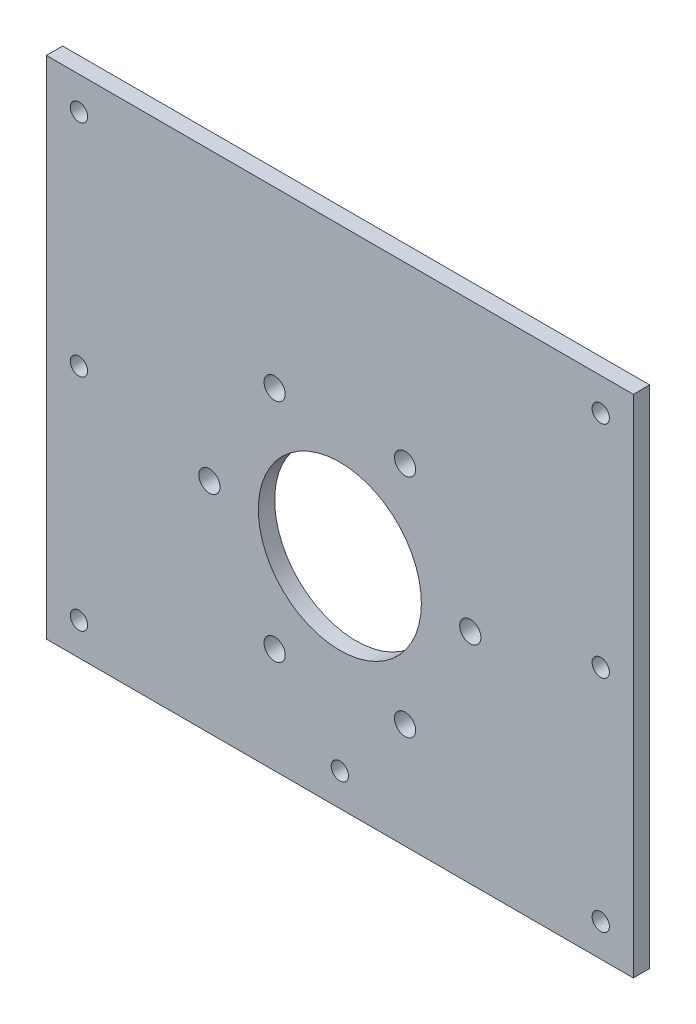
ISO-10303-21;
HEADER;
FILE_DESCRIPTION(('STEP AP214'),'2;1');
FILE_NAME('part.step','',(''),(''),'','','');
FILE_SCHEMA(('AUTOMOTIVE_DESIGN { 1 0 10303 214 1 1 1 1 }'));
ENDSEC;
DATA;
#1=APPLICATION_CONTEXT('core data for automotive mechanical design processes');
#2=APPLICATION_PROTOCOL_DEFINITION('international standard','automotive_design',2000,#1);
#3=PRODUCT_CONTEXT('',#1,'mechanical');
#4=PRODUCT('Part','Part','',(#3));
#5=PRODUCT_RELATED_PRODUCT_CATEGORY('part','',(#4));
#6=PRODUCT_DEFINITION_FORMATION('','',#4);
#7=PRODUCT_DEFINITION_CONTEXT('part definition',#1,'design');
#8=PRODUCT_DEFINITION('design','',#6,#7);
#9=PRODUCT_DEFINITION_SHAPE('','',#8);
#10=(LENGTH_UNIT() NAMED_UNIT(*) SI_UNIT(.MILLI.,.METRE.));
#11=(NAMED_UNIT(*) PLANE_ANGLE_UNIT() SI_UNIT($,.RADIAN.));
#12=(NAMED_UNIT(*) SI_UNIT($,.STERADIAN.) SOLID_ANGLE_UNIT());
#13=UNCERTAINTY_MEASURE_WITH_UNIT(LENGTH_MEASURE(1.E-05),#10,'distance_accuracy_value','');
#14=(GEOMETRIC_REPRESENTATION_CONTEXT(3) GLOBAL_UNCERTAINTY_ASSIGNED_CONTEXT((#13)) GLOBAL_UNIT_ASSIGNED_CONTEXT((#10,
#11,#12)) REPRESENTATION_CONTEXT('',''));
#15=CARTESIAN_POINT('',(0.,0.,0.));
#16=DIRECTION('',(0.,0.,1.));
#17=DIRECTION('',(1.,0.,0.));
#18=AXIS2_PLACEMENT_3D('',#15,#16,#17);
#19=CARTESIAN_POINT('',(0.,0.,5.));
#20=DIRECTION('',(1.,0.,0.));
#21=DIRECTION('',(0.,0.,-1.));
#22=AXIS2_PLACEMENT_3D('',#19,#20,#21);
#23=PLANE('',#22);
#24=DIRECTION('',(0.,-1.,0.));
#25=VECTOR('',#24,1.);
#26=CARTESIAN_POINT('',(0.,0.,0.));
#27=LINE('',#26,#25);
#28=CARTESIAN_POINT('',(0.,155.,0.));
#29=VERTEX_POINT('',#28);
#30=CARTESIAN_POINT('',(0.,0.,0.));
#31=VERTEX_POINT('',#30);
#32=EDGE_CURVE('E101',#29,#31,#27,.T.);
#33=ORIENTED_EDGE('',*,*,#32,.T.);
#34=DIRECTION('',(0.,0.,-1.));
#35=VECTOR('',#34,1.);
#36=CARTESIAN_POINT('',(0.,0.,5.));
#37=LINE('',#36,#35);
#38=CARTESIAN_POINT('',(0.,0.,5.));
#39=VERTEX_POINT('',#38);
#40=EDGE_CURVE('E11',#39,#31,#37,.T.);
#41=ORIENTED_EDGE('',*,*,#40,.F.);
#42=DIRECTION('',(0.,-1.,0.));
#43=VECTOR('',#42,1.);
#44=CARTESIAN_POINT('',(0.,0.,5.));
#45=LINE('',#44,#43);
#46=CARTESIAN_POINT('',(0.,155.,5.));
#47=VERTEX_POINT('',#46);
#48=EDGE_CURVE('E89',#47,#39,#45,.T.);
#49=ORIENTED_EDGE('',*,*,#48,.F.);
#50=DIRECTION('',(0.,0.,-1.));
#51=VECTOR('',#50,1.);
#52=CARTESIAN_POINT('',(0.,155.,5.));
#53=LINE('',#52,#51);
#54=EDGE_CURVE('E97',#47,#29,#53,.T.);
#55=ORIENTED_EDGE('',*,*,#54,.T.);
#56=EDGE_LOOP('',(#33,#41,#49,#55));
#57=FACE_BOUND('',#56,.T.);
#58=ADVANCED_FACE('F38',(#57),#23,.F.);
#59=CARTESIAN_POINT('',(0.,0.,5.));
#60=DIRECTION('',(0.,1.,0.));
#61=DIRECTION('',(0.,0.,1.));
#62=AXIS2_PLACEMENT_3D('',#59,#60,#61);
#63=PLANE('',#62);
#64=DIRECTION('',(1.,0.,0.));
#65=VECTOR('',#64,1.);
#66=CARTESIAN_POINT('',(0.,0.,0.));
#67=LINE('',#66,#65);
#68=CARTESIAN_POINT('',(180.,0.,0.));
#69=VERTEX_POINT('',#68);
#70=EDGE_CURVE('E93',#31,#69,#67,.T.);
#71=ORIENTED_EDGE('',*,*,#70,.T.);
#72=DIRECTION('',(0.,0.,-1.));
#73=VECTOR('',#72,1.);
#74=CARTESIAN_POINT('',(180.,0.,5.));
#75=LINE('',#74,#73);
#76=CARTESIAN_POINT('',(180.,0.,5.));
#77=VERTEX_POINT('',#76);
#78=EDGE_CURVE('E46',#77,#69,#75,.T.);
#79=ORIENTED_EDGE('',*,*,#78,.F.);
#80=DIRECTION('',(1.,0.,0.));
#81=VECTOR('',#80,1.);
#82=CARTESIAN_POINT('',(0.,0.,5.));
#83=LINE('',#82,#81);
#84=EDGE_CURVE('E84',#39,#77,#83,.T.);
#85=ORIENTED_EDGE('',*,*,#84,.F.);
#86=ORIENTED_EDGE('',*,*,#40,.T.);
#87=EDGE_LOOP('',(#71,#79,#85,#86));
#88=FACE_BOUND('',#87,.T.);
#89=ADVANCED_FACE('F92',(#88),#63,.F.);
#90=CARTESIAN_POINT('',(180.,0.,5.));
#91=DIRECTION('',(-1.,0.,0.));
#92=DIRECTION('',(0.,0.,1.));
#93=AXIS2_PLACEMENT_3D('',#90,#91,#92);
#94=PLANE('',#93);
#95=DIRECTION('',(0.,1.,0.));
#96=VECTOR('',#95,1.);
#97=CARTESIAN_POINT('',(180.,0.,0.));
#98=LINE('',#97,#96);
#99=CARTESIAN_POINT('',(180.,155.,0.));
#100=VERTEX_POINT('',#99);
#101=EDGE_CURVE('E71',#69,#100,#98,.T.);
#102=ORIENTED_EDGE('',*,*,#101,.T.);
#103=DIRECTION('',(0.,0.,-1.));
#104=VECTOR('',#103,1.);
#105=CARTESIAN_POINT('',(180.,155.,5.));
#106=LINE('',#105,#104);
#107=CARTESIAN_POINT('',(180.,155.,5.));
#108=VERTEX_POINT('',#107);
#109=EDGE_CURVE('E94',#108,#100,#106,.T.);
#110=ORIENTED_EDGE('',*,*,#109,.F.);
#111=DIRECTION('',(0.,1.,0.));
#112=VECTOR('',#111,1.);
#113=CARTESIAN_POINT('',(180.,0.,5.));
#114=LINE('',#113,#112);
#115=EDGE_CURVE('E87',#77,#108,#114,.T.);
#116=ORIENTED_EDGE('',*,*,#115,.F.);
#117=ORIENTED_EDGE('',*,*,#78,.T.);
#118=EDGE_LOOP('',(#102,#110,#116,#117));
#119=FACE_BOUND('',#118,.T.);
#120=ADVANCED_FACE('F95',(#119),#94,.F.);
#121=CARTESIAN_POINT('',(0.,155.,5.));
#122=DIRECTION('',(0.,-1.,0.));
#123=DIRECTION('',(0.,0.,-1.));
#124=AXIS2_PLACEMENT_3D('',#121,#122,#123);
#125=PLANE('',#124);
#126=DIRECTION('',(-1.,0.,0.));
#127=VECTOR('',#126,1.);
#128=CARTESIAN_POINT('',(0.,155.,0.));
#129=LINE('',#128,#127);
#130=EDGE_CURVE('E77',#100,#29,#129,.T.);
#131=ORIENTED_EDGE('',*,*,#130,.T.);
#132=ORIENTED_EDGE('',*,*,#54,.F.);
#133=DIRECTION('',(-1.,0.,0.));
#134=VECTOR('',#133,1.);
#135=CARTESIAN_POINT('',(0.,155.,5.));
#136=LINE('',#135,#134);
#137=EDGE_CURVE('E54',#108,#47,#136,.T.);
#138=ORIENTED_EDGE('',*,*,#137,.F.);
#139=ORIENTED_EDGE('',*,*,#109,.T.);
#140=EDGE_LOOP('',(#131,#132,#138,#139));
#141=FACE_BOUND('',#140,.T.);
#142=ADVANCED_FACE('F109',(#141),#125,.F.);
#143=CARTESIAN_POINT('',(0.,0.,5.));
#144=DIRECTION('',(0.,0.,-1.));
#145=DIRECTION('',(-1.,0.,0.));
#146=AXIS2_PLACEMENT_3D('',#143,#144,#145);
#147=PLANE('',#146);
#148=CARTESIAN_POINT('',(10.,10.,5.));
#149=DIRECTION('',(0.,0.,1.));
#150=DIRECTION('',(1.,0.,0.));
#151=AXIS2_PLACEMENT_3D('',#148,#149,#150);
#152=CIRCLE('',#151,2.65);
#153=CARTESIAN_POINT('',(12.65,10.,5.));
#154=VERTEX_POINT('',#153);
#155=EDGE_CURVE('E154',#154,#154,#152,.T.);
#156=ORIENTED_EDGE('',*,*,#155,.F.);
#157=EDGE_LOOP('',(#156));
#158=FACE_BOUND('',#157,.T.);
#159=CARTESIAN_POINT('',(10.,77.5,5.));
#160=DIRECTION('',(0.,0.,1.));
#161=DIRECTION('',(1.,0.,0.));
#162=AXIS2_PLACEMENT_3D('',#159,#160,#161);
#163=CIRCLE('',#162,2.65);
#164=CARTESIAN_POINT('',(12.65,77.5,5.));
#165=VERTEX_POINT('',#164);
#166=EDGE_CURVE('E161',#165,#165,#163,.T.);
#167=ORIENTED_EDGE('',*,*,#166,.F.);
#168=EDGE_LOOP('',(#167));
#169=FACE_BOUND('',#168,.T.);
#170=CARTESIAN_POINT('',(10.,145.,5.));
#171=DIRECTION('',(0.,0.,1.));
#172=DIRECTION('',(1.,0.,0.));
#173=AXIS2_PLACEMENT_3D('',#170,#171,#172);
#174=CIRCLE('',#173,2.65000000000001);
#175=CARTESIAN_POINT('',(12.65,145.,5.));
#176=VERTEX_POINT('',#175);
#177=EDGE_CURVE('E167',#176,#176,#174,.T.);
#178=ORIENTED_EDGE('',*,*,#177,.F.);
#179=EDGE_LOOP('',(#178));
#180=FACE_BOUND('',#179,.T.);
#181=CARTESIAN_POINT('',(70.,101.641016151378,5.));
#182=DIRECTION('',(0.,0.,1.));
#183=DIRECTION('',(1.,0.,0.));
#184=AXIS2_PLACEMENT_3D('',#181,#182,#183);
#185=CIRCLE('',#184,3.25000000000001);
#186=CARTESIAN_POINT('',(73.25,101.641016151378,5.));
#187=VERTEX_POINT('',#186);
#188=EDGE_CURVE('E131',#187,#187,#185,.T.);
#189=ORIENTED_EDGE('',*,*,#188,.F.);
#190=EDGE_LOOP('',(#189));
#191=FACE_BOUND('',#190,.T.);
#192=CARTESIAN_POINT('',(50.,67.,5.));
#193=DIRECTION('',(0.,0.,1.));
#194=DIRECTION('',(1.,0.,0.));
#195=AXIS2_PLACEMENT_3D('',#192,#193,#194);
#196=CIRCLE('',#195,3.25);
#197=CARTESIAN_POINT('',(53.25,67.,5.));
#198=VERTEX_POINT('',#197);
#199=EDGE_CURVE('E130',#198,#198,#196,.T.);
#200=ORIENTED_EDGE('',*,*,#199,.F.);
#201=EDGE_LOOP('',(#200));
#202=FACE_BOUND('',#201,.T.);
#203=CARTESIAN_POINT('',(70.,32.3589838486225,5.));
#204=DIRECTION('',(0.,0.,1.));
#205=DIRECTION('',(1.,0.,0.));
#206=AXIS2_PLACEMENT_3D('',#203,#204,#205);
#207=CIRCLE('',#206,3.25000000000001);
#208=CARTESIAN_POINT('',(73.25,32.3589838486225,5.));
#209=VERTEX_POINT('',#208);
#210=EDGE_CURVE('E137',#209,#209,#207,.T.);
#211=ORIENTED_EDGE('',*,*,#210,.F.);
#212=EDGE_LOOP('',(#211));
#213=FACE_BOUND('',#212,.T.);
#214=CARTESIAN_POINT('',(110.,32.3589838486225,5.));
#215=DIRECTION('',(0.,0.,1.));
#216=DIRECTION('',(1.,0.,0.));
#217=AXIS2_PLACEMENT_3D('',#214,#215,#216);
#218=CIRCLE('',#217,3.25000000000001);
#219=CARTESIAN_POINT('',(113.25,32.3589838486225,5.));
#220=VERTEX_POINT('',#219);
#221=EDGE_CURVE('E143',#220,#220,#218,.T.);
#222=ORIENTED_EDGE('',*,*,#221,.F.);
#223=EDGE_LOOP('',(#222));
#224=FACE_BOUND('',#223,.T.);
#225=CARTESIAN_POINT('',(130.,67.,5.));
#226=DIRECTION('',(0.,0.,1.));
#227=DIRECTION('',(1.,0.,0.));
#228=AXIS2_PLACEMENT_3D('',#225,#226,#227);
#229=CIRCLE('',#228,3.24999999999972);
#230=CARTESIAN_POINT('',(133.25,67.,5.));
#231=VERTEX_POINT('',#230);
#232=EDGE_CURVE('E124',#231,#231,#229,.T.);
#233=ORIENTED_EDGE('',*,*,#232,.F.);
#234=EDGE_LOOP('',(#233));
#235=FACE_BOUND('',#234,.T.);
#236=CARTESIAN_POINT('',(90.,9.99999999999999,5.));
#237=DIRECTION('',(0.,0.,1.));
#238=DIRECTION('',(1.,0.,0.));
#239=AXIS2_PLACEMENT_3D('',#236,#237,#238);
#240=CIRCLE('',#239,2.65);
#241=CARTESIAN_POINT('',(92.65,9.99999999999999,5.));
#242=VERTEX_POINT('',#241);
#243=EDGE_CURVE('E190',#242,#242,#240,.T.);
#244=ORIENTED_EDGE('',*,*,#243,.F.);
#245=EDGE_LOOP('',(#244));
#246=FACE_BOUND('',#245,.T.);
#247=CARTESIAN_POINT('',(170.,145.,5.));
#248=DIRECTION('',(0.,0.,1.));
#249=DIRECTION('',(-1.,0.,0.));
#250=AXIS2_PLACEMENT_3D('',#247,#248,#249);
#251=CIRCLE('',#250,2.64999999999998);
#252=CARTESIAN_POINT('',(167.35,145.,5.));
#253=VERTEX_POINT('',#252);
#254=EDGE_CURVE('E179',#253,#253,#251,.T.);
#255=ORIENTED_EDGE('',*,*,#254,.F.);
#256=EDGE_LOOP('',(#255));
#257=FACE_BOUND('',#256,.T.);
#258=CARTESIAN_POINT('',(170.,77.5,5.));
#259=DIRECTION('',(0.,0.,1.));
#260=DIRECTION('',(-1.,0.,0.));
#261=AXIS2_PLACEMENT_3D('',#258,#259,#260);
#262=CIRCLE('',#261,2.64999999999999);
#263=CARTESIAN_POINT('',(167.35,77.5,5.));
#264=VERTEX_POINT('',#263);
#265=EDGE_CURVE('E178',#264,#264,#262,.T.);
#266=ORIENTED_EDGE('',*,*,#265,.F.);
#267=EDGE_LOOP('',(#266));
#268=FACE_BOUND('',#267,.T.);
#269=CARTESIAN_POINT('',(170.,9.99999999999989,5.));
#270=DIRECTION('',(0.,0.,1.));
#271=DIRECTION('',(-1.,0.,0.));
#272=AXIS2_PLACEMENT_3D('',#269,#270,#271);
#273=CIRCLE('',#272,2.64999999999999);
#274=CARTESIAN_POINT('',(167.35,9.99999999999989,5.));
#275=VERTEX_POINT('',#274);
#276=EDGE_CURVE('E155',#275,#275,#273,.T.);
#277=ORIENTED_EDGE('',*,*,#276,.F.);
#278=EDGE_LOOP('',(#277));
#279=FACE_BOUND('',#278,.T.);
#280=CARTESIAN_POINT('',(110.,101.641016151378,5.));
#281=DIRECTION('',(0.,0.,1.));
#282=DIRECTION('',(1.,0.,0.));
#283=AXIS2_PLACEMENT_3D('',#280,#281,#282);
#284=CIRCLE('',#283,3.25000000000001);
#285=CARTESIAN_POINT('',(113.25,101.641016151378,5.));
#286=VERTEX_POINT('',#285);
#287=EDGE_CURVE('E121',#286,#286,#284,.T.);
#288=ORIENTED_EDGE('',*,*,#287,.F.);
#289=EDGE_LOOP('',(#288));
#290=FACE_BOUND('',#289,.T.);
#291=CARTESIAN_POINT('',(90.,67.,5.));
#292=DIRECTION('',(0.,0.,1.));
#293=DIRECTION('',(1.,0.,0.));
#294=AXIS2_PLACEMENT_3D('',#291,#292,#293);
#295=CIRCLE('',#294,25.);
#296=CARTESIAN_POINT('',(115.,67.,5.));
#297=VERTEX_POINT('',#296);
#298=EDGE_CURVE('E115',#297,#297,#295,.T.);
#299=ORIENTED_EDGE('',*,*,#298,.F.);
#300=EDGE_LOOP('',(#299));
#301=FACE_BOUND('',#300,.T.);
#302=ORIENTED_EDGE('',*,*,#48,.T.);
#303=ORIENTED_EDGE('',*,*,#84,.T.);
#304=ORIENTED_EDGE('',*,*,#115,.T.);
#305=ORIENTED_EDGE('',*,*,#137,.T.);
#306=EDGE_LOOP('',(#302,#303,#304,#305));
#307=FACE_BOUND('',#306,.T.);
#308=ADVANCED_FACE('F85',(#158,#169,#180,#191,#202,#213,#224,#235,#246,#257,#268,#279,#290,#301,
#307),#147,.F.);
#309=CARTESIAN_POINT('',(0.,0.,0.));
#310=DIRECTION('',(0.,0.,-1.));
#311=DIRECTION('',(-1.,0.,0.));
#312=AXIS2_PLACEMENT_3D('',#309,#310,#311);
#313=PLANE('',#312);
#314=CARTESIAN_POINT('',(10.,10.,0.));
#315=DIRECTION('',(0.,0.,1.));
#316=DIRECTION('',(1.,0.,0.));
#317=AXIS2_PLACEMENT_3D('',#314,#315,#316);
#318=CIRCLE('',#317,2.65);
#319=CARTESIAN_POINT('',(12.65,10.,0.));
#320=VERTEX_POINT('',#319);
#321=EDGE_CURVE('E151',#320,#320,#318,.T.);
#322=ORIENTED_EDGE('',*,*,#321,.T.);
#323=EDGE_LOOP('',(#322));
#324=FACE_BOUND('',#323,.T.);
#325=CARTESIAN_POINT('',(10.,77.5,0.));
#326=DIRECTION('',(0.,0.,1.));
#327=DIRECTION('',(1.,0.,0.));
#328=AXIS2_PLACEMENT_3D('',#325,#326,#327);
#329=CIRCLE('',#328,2.65);
#330=CARTESIAN_POINT('',(12.65,77.5,0.));
#331=VERTEX_POINT('',#330);
#332=EDGE_CURVE('E158',#331,#331,#329,.T.);
#333=ORIENTED_EDGE('',*,*,#332,.T.);
#334=EDGE_LOOP('',(#333));
#335=FACE_BOUND('',#334,.T.);
#336=CARTESIAN_POINT('',(10.,145.,0.));
#337=DIRECTION('',(0.,0.,1.));
#338=DIRECTION('',(1.,0.,0.));
#339=AXIS2_PLACEMENT_3D('',#336,#337,#338);
#340=CIRCLE('',#339,2.65000000000001);
#341=CARTESIAN_POINT('',(12.65,145.,0.));
#342=VERTEX_POINT('',#341);
#343=EDGE_CURVE('E164',#342,#342,#340,.T.);
#344=ORIENTED_EDGE('',*,*,#343,.T.);
#345=EDGE_LOOP('',(#344));
#346=FACE_BOUND('',#345,.T.);
#347=CARTESIAN_POINT('',(70.,101.641016151378,0.));
#348=DIRECTION('',(0.,0.,1.));
#349=DIRECTION('',(1.,0.,0.));
#350=AXIS2_PLACEMENT_3D('',#347,#348,#349);
#351=CIRCLE('',#350,3.25000000000001);
#352=CARTESIAN_POINT('',(73.25,101.641016151378,0.));
#353=VERTEX_POINT('',#352);
#354=EDGE_CURVE('E170',#353,#353,#351,.T.);
#355=ORIENTED_EDGE('',*,*,#354,.T.);
#356=EDGE_LOOP('',(#355));
#357=FACE_BOUND('',#356,.T.);
#358=CARTESIAN_POINT('',(50.,67.,0.));
#359=DIRECTION('',(0.,0.,1.));
#360=DIRECTION('',(1.,0.,0.));
#361=AXIS2_PLACEMENT_3D('',#358,#359,#360);
#362=CIRCLE('',#361,3.25);
#363=CARTESIAN_POINT('',(53.25,67.,0.));
#364=VERTEX_POINT('',#363);
#365=EDGE_CURVE('E127',#364,#364,#362,.T.);
#366=ORIENTED_EDGE('',*,*,#365,.T.);
#367=EDGE_LOOP('',(#366));
#368=FACE_BOUND('',#367,.T.);
#369=CARTESIAN_POINT('',(70.,32.3589838486225,0.));
#370=DIRECTION('',(0.,0.,1.));
#371=DIRECTION('',(1.,0.,0.));
#372=AXIS2_PLACEMENT_3D('',#369,#370,#371);
#373=CIRCLE('',#372,3.25000000000001);
#374=CARTESIAN_POINT('',(73.25,32.3589838486225,0.));
#375=VERTEX_POINT('',#374);
#376=EDGE_CURVE('E134',#375,#375,#373,.T.);
#377=ORIENTED_EDGE('',*,*,#376,.T.);
#378=EDGE_LOOP('',(#377));
#379=FACE_BOUND('',#378,.T.);
#380=CARTESIAN_POINT('',(110.,32.3589838486225,0.));
#381=DIRECTION('',(0.,0.,1.));
#382=DIRECTION('',(1.,0.,0.));
#383=AXIS2_PLACEMENT_3D('',#380,#381,#382);
#384=CIRCLE('',#383,3.25000000000001);
#385=CARTESIAN_POINT('',(113.25,32.3589838486225,0.));
#386=VERTEX_POINT('',#385);
#387=EDGE_CURVE('E140',#386,#386,#384,.T.);
#388=ORIENTED_EDGE('',*,*,#387,.T.);
#389=EDGE_LOOP('',(#388));
#390=FACE_BOUND('',#389,.T.);
#391=CARTESIAN_POINT('',(130.,67.,0.));
#392=DIRECTION('',(0.,0.,1.));
#393=DIRECTION('',(1.,0.,0.));
#394=AXIS2_PLACEMENT_3D('',#391,#392,#393);
#395=CIRCLE('',#394,3.24999999999972);
#396=CARTESIAN_POINT('',(133.25,67.,0.));
#397=VERTEX_POINT('',#396);
#398=EDGE_CURVE('E146',#397,#397,#395,.T.);
#399=ORIENTED_EDGE('',*,*,#398,.T.);
#400=EDGE_LOOP('',(#399));
#401=FACE_BOUND('',#400,.T.);
#402=CARTESIAN_POINT('',(90.,9.99999999999999,0.));
#403=DIRECTION('',(0.,0.,1.));
#404=DIRECTION('',(1.,0.,0.));
#405=AXIS2_PLACEMENT_3D('',#402,#403,#404);
#406=CIRCLE('',#405,2.65);
#407=CARTESIAN_POINT('',(92.65,9.99999999999999,0.));
#408=VERTEX_POINT('',#407);
#409=EDGE_CURVE('E187',#408,#408,#406,.T.);
#410=ORIENTED_EDGE('',*,*,#409,.T.);
#411=EDGE_LOOP('',(#410));
#412=FACE_BOUND('',#411,.T.);
#413=CARTESIAN_POINT('',(170.,145.,0.));
#414=DIRECTION('',(0.,0.,1.));
#415=DIRECTION('',(-1.,0.,0.));
#416=AXIS2_PLACEMENT_3D('',#413,#414,#415);
#417=CIRCLE('',#416,2.64999999999998);
#418=CARTESIAN_POINT('',(167.35,145.,0.));
#419=VERTEX_POINT('',#418);
#420=EDGE_CURVE('E193',#419,#419,#417,.T.);
#421=ORIENTED_EDGE('',*,*,#420,.T.);
#422=EDGE_LOOP('',(#421));
#423=FACE_BOUND('',#422,.T.);
#424=CARTESIAN_POINT('',(170.,77.5,0.));
#425=DIRECTION('',(0.,0.,1.));
#426=DIRECTION('',(-1.,0.,0.));
#427=AXIS2_PLACEMENT_3D('',#424,#425,#426);
#428=CIRCLE('',#427,2.64999999999999);
#429=CARTESIAN_POINT('',(167.35,77.5,0.));
#430=VERTEX_POINT('',#429);
#431=EDGE_CURVE('E175',#430,#430,#428,.T.);
#432=ORIENTED_EDGE('',*,*,#431,.T.);
#433=EDGE_LOOP('',(#432));
#434=FACE_BOUND('',#433,.T.);
#435=CARTESIAN_POINT('',(170.,9.99999999999989,0.));
#436=DIRECTION('',(0.,0.,1.));
#437=DIRECTION('',(-1.,0.,0.));
#438=AXIS2_PLACEMENT_3D('',#435,#436,#437);
#439=CIRCLE('',#438,2.64999999999999);
#440=CARTESIAN_POINT('',(167.35,9.99999999999989,0.));
#441=VERTEX_POINT('',#440);
#442=EDGE_CURVE('E182',#441,#441,#439,.T.);
#443=ORIENTED_EDGE('',*,*,#442,.T.);
#444=EDGE_LOOP('',(#443));
#445=FACE_BOUND('',#444,.T.);
#446=CARTESIAN_POINT('',(110.,101.641016151378,0.));
#447=DIRECTION('',(0.,0.,1.));
#448=DIRECTION('',(1.,0.,0.));
#449=AXIS2_PLACEMENT_3D('',#446,#447,#448);
#450=CIRCLE('',#449,3.25000000000001);
#451=CARTESIAN_POINT('',(113.25,101.641016151378,0.));
#452=VERTEX_POINT('',#451);
#453=EDGE_CURVE('E118',#452,#452,#450,.T.);
#454=ORIENTED_EDGE('',*,*,#453,.T.);
#455=EDGE_LOOP('',(#454));
#456=FACE_BOUND('',#455,.T.);
#457=CARTESIAN_POINT('',(90.,67.,0.));
#458=DIRECTION('',(0.,0.,1.));
#459=DIRECTION('',(1.,0.,0.));
#460=AXIS2_PLACEMENT_3D('',#457,#458,#459);
#461=CIRCLE('',#460,25.);
#462=CARTESIAN_POINT('',(115.,67.,0.));
#463=VERTEX_POINT('',#462);
#464=EDGE_CURVE('E104',#463,#463,#461,.T.);
#465=ORIENTED_EDGE('',*,*,#464,.T.);
#466=EDGE_LOOP('',(#465));
#467=FACE_BOUND('',#466,.T.);
#468=ORIENTED_EDGE('',*,*,#32,.F.);
#469=ORIENTED_EDGE('',*,*,#130,.F.);
#470=ORIENTED_EDGE('',*,*,#101,.F.);
#471=ORIENTED_EDGE('',*,*,#70,.F.);
#472=EDGE_LOOP('',(#468,#469,#470,#471));
#473=FACE_BOUND('',#472,.T.);
#474=ADVANCED_FACE('F112',(#324,#335,#346,#357,#368,#379,#390,#401,#412,#423,#434,#445,#456,
#467,#473),#313,.T.);
#475=CARTESIAN_POINT('',(90.,67.,0.));
#476=DIRECTION('',(0.,0.,1.));
#477=DIRECTION('',(1.,0.,0.));
#478=AXIS2_PLACEMENT_3D('',#475,#476,#477);
#479=CYLINDRICAL_SURFACE('',#478,25.);
#480=ORIENTED_EDGE('',*,*,#464,.F.);
#481=EDGE_LOOP('',(#480));
#482=FACE_BOUND('',#481,.T.);
#483=ORIENTED_EDGE('',*,*,#298,.T.);
#484=EDGE_LOOP('',(#483));
#485=FACE_BOUND('',#484,.T.);
#486=ADVANCED_FACE('F213',(#482,#485),#479,.F.);
#487=CARTESIAN_POINT('',(110.,101.641016151378,0.));
#488=DIRECTION('',(0.,0.,1.));
#489=DIRECTION('',(1.,0.,0.));
#490=AXIS2_PLACEMENT_3D('',#487,#488,#489);
#491=CYLINDRICAL_SURFACE('',#490,3.25000000000001);
#492=ORIENTED_EDGE('',*,*,#453,.F.);
#493=EDGE_LOOP('',(#492));
#494=FACE_BOUND('',#493,.T.);
#495=ORIENTED_EDGE('',*,*,#287,.T.);
#496=EDGE_LOOP('',(#495));
#497=FACE_BOUND('',#496,.T.);
#498=ADVANCED_FACE('F215',(#494,#497),#491,.F.);
#499=CARTESIAN_POINT('',(170.,9.99999999999989,0.));
#500=DIRECTION('',(0.,0.,1.));
#501=DIRECTION('',(1.,0.,0.));
#502=AXIS2_PLACEMENT_3D('',#499,#500,#501);
#503=CYLINDRICAL_SURFACE('',#502,2.64999999999999);
#504=ORIENTED_EDGE('',*,*,#442,.F.);
#505=EDGE_LOOP('',(#504));
#506=FACE_BOUND('',#505,.T.);
#507=ORIENTED_EDGE('',*,*,#276,.T.);
#508=EDGE_LOOP('',(#507));
#509=FACE_BOUND('',#508,.T.);
#510=ADVANCED_FACE('F222',(#506,#509),#503,.F.);
#511=CARTESIAN_POINT('',(170.,77.5,0.));
#512=DIRECTION('',(0.,0.,1.));
#513=DIRECTION('',(1.,0.,0.));
#514=AXIS2_PLACEMENT_3D('',#511,#512,#513);
#515=CYLINDRICAL_SURFACE('',#514,2.64999999999999);
#516=ORIENTED_EDGE('',*,*,#431,.F.);
#517=EDGE_LOOP('',(#516));
#518=FACE_BOUND('',#517,.T.);
#519=ORIENTED_EDGE('',*,*,#265,.T.);
#520=EDGE_LOOP('',(#519));
#521=FACE_BOUND('',#520,.T.);
#522=ADVANCED_FACE('F282',(#518,#521),#515,.F.);
#523=CARTESIAN_POINT('',(170.,145.,0.));
#524=DIRECTION('',(0.,0.,1.));
#525=DIRECTION('',(1.,0.,0.));
#526=AXIS2_PLACEMENT_3D('',#523,#524,#525);
#527=CYLINDRICAL_SURFACE('',#526,2.64999999999998);
#528=ORIENTED_EDGE('',*,*,#420,.F.);
#529=EDGE_LOOP('',(#528));
#530=FACE_BOUND('',#529,.T.);
#531=ORIENTED_EDGE('',*,*,#254,.T.);
#532=EDGE_LOOP('',(#531));
#533=FACE_BOUND('',#532,.T.);
#534=ADVANCED_FACE('F199',(#530,#533),#527,.F.);
#535=CARTESIAN_POINT('',(90.,9.99999999999999,0.));
#536=DIRECTION('',(0.,0.,1.));
#537=DIRECTION('',(1.,0.,0.));
#538=AXIS2_PLACEMENT_3D('',#535,#536,#537);
#539=CYLINDRICAL_SURFACE('',#538,2.65);
#540=ORIENTED_EDGE('',*,*,#409,.F.);
#541=EDGE_LOOP('',(#540));
#542=FACE_BOUND('',#541,.T.);
#543=ORIENTED_EDGE('',*,*,#243,.T.);
#544=EDGE_LOOP('',(#543));
#545=FACE_BOUND('',#544,.T.);
#546=ADVANCED_FACE('F299',(#542,#545),#539,.F.);
#547=CARTESIAN_POINT('',(130.,67.,0.));
#548=DIRECTION('',(0.,0.,1.));
#549=DIRECTION('',(1.,0.,0.));
#550=AXIS2_PLACEMENT_3D('',#547,#548,#549);
#551=CYLINDRICAL_SURFACE('',#550,3.24999999999972);
#552=ORIENTED_EDGE('',*,*,#398,.F.);
#553=EDGE_LOOP('',(#552));
#554=FACE_BOUND('',#553,.T.);
#555=ORIENTED_EDGE('',*,*,#232,.T.);
#556=EDGE_LOOP('',(#555));
#557=FACE_BOUND('',#556,.T.);
#558=ADVANCED_FACE('F308',(#554,#557),#551,.F.);
#559=CARTESIAN_POINT('',(110.,32.3589838486225,0.));
#560=DIRECTION('',(0.,0.,1.));
#561=DIRECTION('',(1.,0.,0.));
#562=AXIS2_PLACEMENT_3D('',#559,#560,#561);
#563=CYLINDRICAL_SURFACE('',#562,3.25000000000001);
#564=ORIENTED_EDGE('',*,*,#387,.F.);
#565=EDGE_LOOP('',(#564));
#566=FACE_BOUND('',#565,.T.);
#567=ORIENTED_EDGE('',*,*,#221,.T.);
#568=EDGE_LOOP('',(#567));
#569=FACE_BOUND('',#568,.T.);
#570=ADVANCED_FACE('F317',(#566,#569),#563,.F.);
#571=CARTESIAN_POINT('',(70.,32.3589838486225,0.));
#572=DIRECTION('',(0.,0.,1.));
#573=DIRECTION('',(1.,0.,0.));
#574=AXIS2_PLACEMENT_3D('',#571,#572,#573);
#575=CYLINDRICAL_SURFACE('',#574,3.25000000000001);
#576=ORIENTED_EDGE('',*,*,#376,.F.);
#577=EDGE_LOOP('',(#576));
#578=FACE_BOUND('',#577,.T.);
#579=ORIENTED_EDGE('',*,*,#210,.T.);
#580=EDGE_LOOP('',(#579));
#581=FACE_BOUND('',#580,.T.);
#582=ADVANCED_FACE('F326',(#578,#581),#575,.F.);
#583=CARTESIAN_POINT('',(50.,67.,0.));
#584=DIRECTION('',(0.,0.,1.));
#585=DIRECTION('',(1.,0.,0.));
#586=AXIS2_PLACEMENT_3D('',#583,#584,#585);
#587=CYLINDRICAL_SURFACE('',#586,3.25);
#588=ORIENTED_EDGE('',*,*,#365,.F.);
#589=EDGE_LOOP('',(#588));
#590=FACE_BOUND('',#589,.T.);
#591=ORIENTED_EDGE('',*,*,#199,.T.);
#592=EDGE_LOOP('',(#591));
#593=FACE_BOUND('',#592,.T.);
#594=ADVANCED_FACE('F335',(#590,#593),#587,.F.);
#595=CARTESIAN_POINT('',(70.,101.641016151378,0.));
#596=DIRECTION('',(0.,0.,1.));
#597=DIRECTION('',(1.,0.,0.));
#598=AXIS2_PLACEMENT_3D('',#595,#596,#597);
#599=CYLINDRICAL_SURFACE('',#598,3.25000000000001);
#600=ORIENTED_EDGE('',*,*,#354,.F.);
#601=EDGE_LOOP('',(#600));
#602=FACE_BOUND('',#601,.T.);
#603=ORIENTED_EDGE('',*,*,#188,.T.);
#604=EDGE_LOOP('',(#603));
#605=FACE_BOUND('',#604,.T.);
#606=ADVANCED_FACE('F344',(#602,#605),#599,.F.);
#607=CARTESIAN_POINT('',(10.,145.,0.));
#608=DIRECTION('',(0.,0.,1.));
#609=DIRECTION('',(1.,0.,0.));
#610=AXIS2_PLACEMENT_3D('',#607,#608,#609);
#611=CYLINDRICAL_SURFACE('',#610,2.65000000000001);
#612=ORIENTED_EDGE('',*,*,#343,.F.);
#613=EDGE_LOOP('',(#612));
#614=FACE_BOUND('',#613,.T.);
#615=ORIENTED_EDGE('',*,*,#177,.T.);
#616=EDGE_LOOP('',(#615));
#617=FACE_BOUND('',#616,.T.);
#618=ADVANCED_FACE('F353',(#614,#617),#611,.F.);
#619=CARTESIAN_POINT('',(10.,77.5,0.));
#620=DIRECTION('',(0.,0.,1.));
#621=DIRECTION('',(1.,0.,0.));
#622=AXIS2_PLACEMENT_3D('',#619,#620,#621);
#623=CYLINDRICAL_SURFACE('',#622,2.65);
#624=ORIENTED_EDGE('',*,*,#332,.F.);
#625=EDGE_LOOP('',(#624));
#626=FACE_BOUND('',#625,.T.);
#627=ORIENTED_EDGE('',*,*,#166,.T.);
#628=EDGE_LOOP('',(#627));
#629=FACE_BOUND('',#628,.T.);
#630=ADVANCED_FACE('F362',(#626,#629),#623,.F.);
#631=CARTESIAN_POINT('',(10.,10.,0.));
#632=DIRECTION('',(0.,0.,1.));
#633=DIRECTION('',(1.,0.,0.));
#634=AXIS2_PLACEMENT_3D('',#631,#632,#633);
#635=CYLINDRICAL_SURFACE('',#634,2.65);
#636=ORIENTED_EDGE('',*,*,#321,.F.);
#637=EDGE_LOOP('',(#636));
#638=FACE_BOUND('',#637,.T.);
#639=ORIENTED_EDGE('',*,*,#155,.T.);
#640=EDGE_LOOP('',(#639));
#641=FACE_BOUND('',#640,.T.);
#642=ADVANCED_FACE('F371',(#638,#641),#635,.F.);
#643=CLOSED_SHELL('',(#58,#89,#120,#142,#308,#474,#486,#498,#510,#522,#534,#546,#558,#570,#582,
#594,#606,#618,#630,#642));
#644=MANIFOLD_SOLID_BREP('B2',#643);
#645=ADVANCED_BREP_SHAPE_REPRESENTATION('',(#18,#644),#14);
#646=SHAPE_DEFINITION_REPRESENTATION(#9,#645);
ENDSEC;
END-ISO-10303-21;
